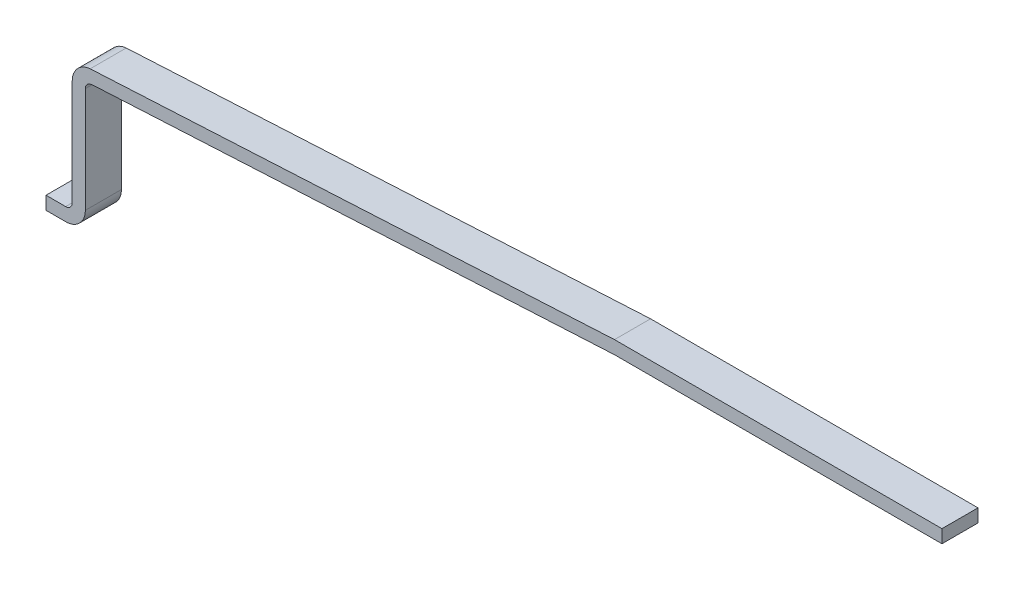
ISO-10303-21;
HEADER;
FILE_DESCRIPTION(('STEP AP214'),'2;1');
FILE_NAME('part.step','',(''),(''),'','','');
FILE_SCHEMA(('AUTOMOTIVE_DESIGN { 1 0 10303 214 1 1 1 1 }'));
ENDSEC;
DATA;
#1=APPLICATION_CONTEXT('core data for automotive mechanical design processes');
#2=APPLICATION_PROTOCOL_DEFINITION('international standard','automotive_design',2000,#1);
#3=PRODUCT_CONTEXT('',#1,'mechanical');
#4=PRODUCT('Part','Part','',(#3));
#5=PRODUCT_RELATED_PRODUCT_CATEGORY('part','',(#4));
#6=PRODUCT_DEFINITION_FORMATION('','',#4);
#7=PRODUCT_DEFINITION_CONTEXT('part definition',#1,'design');
#8=PRODUCT_DEFINITION('design','',#6,#7);
#9=PRODUCT_DEFINITION_SHAPE('','',#8);
#10=(LENGTH_UNIT() NAMED_UNIT(*) SI_UNIT(.MILLI.,.METRE.));
#11=(NAMED_UNIT(*) PLANE_ANGLE_UNIT() SI_UNIT($,.RADIAN.));
#12=(NAMED_UNIT(*) SI_UNIT($,.STERADIAN.) SOLID_ANGLE_UNIT());
#13=UNCERTAINTY_MEASURE_WITH_UNIT(LENGTH_MEASURE(1.E-05),#10,'distance_accuracy_value','');
#14=(GEOMETRIC_REPRESENTATION_CONTEXT(3) GLOBAL_UNCERTAINTY_ASSIGNED_CONTEXT((#13)) GLOBAL_UNIT_ASSIGNED_CONTEXT((#10,
#11,#12)) REPRESENTATION_CONTEXT('',''));
#15=CARTESIAN_POINT('',(0.,0.,0.));
#16=DIRECTION('',(0.,0.,1.));
#17=DIRECTION('',(1.,0.,0.));
#18=AXIS2_PLACEMENT_3D('',#15,#16,#17);
#19=CARTESIAN_POINT('',(-0.319177054542932,12.2710302640645,0.55));
#20=DIRECTION('',(1.,0.,0.));
#21=DIRECTION('',(0.,0.,-1.));
#22=AXIS2_PLACEMENT_3D('',#19,#20,#21);
#23=PLANE('',#22);
#24=DIRECTION('',(0.,-1.,0.));
#25=VECTOR('',#24,1.);
#26=CARTESIAN_POINT('',(-0.319177054542932,12.2710302640645,0.));
#27=LINE('',#26,#25);
#28=CARTESIAN_POINT('',(-0.319177054542932,12.4710302640645,0.));
#29=VERTEX_POINT('',#28);
#30=CARTESIAN_POINT('',(-0.319177054542932,12.2710302640645,0.));
#31=VERTEX_POINT('',#30);
#32=EDGE_CURVE('E172',#29,#31,#27,.T.);
#33=ORIENTED_EDGE('',*,*,#32,.T.);
#34=DIRECTION('',(0.,0.,-1.));
#35=VECTOR('',#34,1.);
#36=CARTESIAN_POINT('',(-0.319177054542932,12.2710302640645,0.55));
#37=LINE('',#36,#35);
#38=CARTESIAN_POINT('',(-0.319177054542932,12.2710302640645,0.55));
#39=VERTEX_POINT('',#38);
#40=EDGE_CURVE('E11',#39,#31,#37,.T.);
#41=ORIENTED_EDGE('',*,*,#40,.F.);
#42=DIRECTION('',(0.,-1.,0.));
#43=VECTOR('',#42,1.);
#44=CARTESIAN_POINT('',(-0.319177054542932,12.2710302640645,0.55));
#45=LINE('',#44,#43);
#46=CARTESIAN_POINT('',(-0.319177054542932,12.4710302640645,0.55));
#47=VERTEX_POINT('',#46);
#48=EDGE_CURVE('E200',#47,#39,#45,.T.);
#49=ORIENTED_EDGE('',*,*,#48,.F.);
#50=DIRECTION('',(0.,0.,-1.));
#51=VECTOR('',#50,1.);
#52=CARTESIAN_POINT('',(-0.319177054542932,12.4710302640645,0.55));
#53=LINE('',#52,#51);
#54=EDGE_CURVE('E168',#47,#29,#53,.T.);
#55=ORIENTED_EDGE('',*,*,#54,.T.);
#56=EDGE_LOOP('',(#33,#41,#49,#55));
#57=FACE_BOUND('',#56,.T.);
#58=ADVANCED_FACE('F34',(#57),#23,.F.);
#59=CARTESIAN_POINT('',(-0.0191770545429775,12.2710302640645,0.55));
#60=DIRECTION('',(0.,1.,0.));
#61=DIRECTION('',(-1.,0.,0.));
#62=AXIS2_PLACEMENT_3D('',#59,#60,#61);
#63=PLANE('',#62);
#64=DIRECTION('',(1.,0.,0.));
#65=VECTOR('',#64,1.);
#66=CARTESIAN_POINT('',(-0.0191770545429775,12.2710302640645,0.));
#67=LINE('',#66,#65);
#68=CARTESIAN_POINT('',(-0.0191770545429775,12.2710302640645,0.));
#69=VERTEX_POINT('',#68);
#70=EDGE_CURVE('E175',#31,#69,#67,.T.);
#71=ORIENTED_EDGE('',*,*,#70,.T.);
#72=DIRECTION('',(0.,0.,-1.));
#73=VECTOR('',#72,1.);
#74=CARTESIAN_POINT('',(-0.0191770545429775,12.2710302640645,0.55));
#75=LINE('',#74,#73);
#76=CARTESIAN_POINT('',(-0.0191770545429775,12.2710302640645,0.55));
#77=VERTEX_POINT('',#76);
#78=EDGE_CURVE('E42',#77,#69,#75,.T.);
#79=ORIENTED_EDGE('',*,*,#78,.F.);
#80=DIRECTION('',(1.,0.,0.));
#81=VECTOR('',#80,1.);
#82=CARTESIAN_POINT('',(-0.0191770545429775,12.2710302640645,0.55));
#83=LINE('',#82,#81);
#84=EDGE_CURVE('E114',#39,#77,#83,.T.);
#85=ORIENTED_EDGE('',*,*,#84,.F.);
#86=ORIENTED_EDGE('',*,*,#40,.T.);
#87=EDGE_LOOP('',(#71,#79,#85,#86));
#88=FACE_BOUND('',#87,.T.);
#89=ADVANCED_FACE('F293',(#88),#63,.F.);
#90=CARTESIAN_POINT('',(-0.0191770545430084,12.5710302640645,0.55));
#91=DIRECTION('',(0.,0.,-1.));
#92=DIRECTION('',(-1.,0.,0.));
#93=AXIS2_PLACEMENT_3D('',#90,#91,#92);
#94=CYLINDRICAL_SURFACE('',#93,0.300000000000008);
#95=CARTESIAN_POINT('',(-0.0191770545430084,12.5710302640645,0.));
#96=DIRECTION('',(0.,0.,1.));
#97=DIRECTION('',(1.,0.,0.));
#98=AXIS2_PLACEMENT_3D('',#95,#96,#97);
#99=CIRCLE('',#98,0.300000000000008);
#100=CARTESIAN_POINT('',(0.280822945457,12.5710302640645,0.));
#101=VERTEX_POINT('',#100);
#102=EDGE_CURVE('E177',#69,#101,#99,.T.);
#103=ORIENTED_EDGE('',*,*,#102,.T.);
#104=DIRECTION('',(0.,0.,-1.));
#105=VECTOR('',#104,1.);
#106=CARTESIAN_POINT('',(0.280822945457,12.5710302640645,0.55));
#107=LINE('',#106,#105);
#108=CARTESIAN_POINT('',(0.280822945457,12.5710302640645,0.55));
#109=VERTEX_POINT('',#108);
#110=EDGE_CURVE('E228',#109,#101,#107,.T.);
#111=ORIENTED_EDGE('',*,*,#110,.F.);
#112=CARTESIAN_POINT('',(-0.0191770545430084,12.5710302640645,0.55));
#113=DIRECTION('',(0.,0.,1.));
#114=DIRECTION('',(1.,0.,0.));
#115=AXIS2_PLACEMENT_3D('',#112,#113,#114);
#116=CIRCLE('',#115,0.300000000000008);
#117=EDGE_CURVE('E236',#77,#109,#116,.T.);
#118=ORIENTED_EDGE('',*,*,#117,.F.);
#119=ORIENTED_EDGE('',*,*,#78,.T.);
#120=EDGE_LOOP('',(#103,#111,#118,#119));
#121=FACE_BOUND('',#120,.T.);
#122=ADVANCED_FACE('F234',(#121),#94,.T.);
#123=CARTESIAN_POINT('',(0.280822945456877,14.1793971466627,0.55));
#124=DIRECTION('',(-1.,0.,0.));
#125=DIRECTION('',(0.,-1.,0.));
#126=AXIS2_PLACEMENT_3D('',#123,#124,#125);
#127=PLANE('',#126);
#128=DIRECTION('',(0.,1.,0.));
#129=VECTOR('',#128,1.);
#130=CARTESIAN_POINT('',(0.280822945456877,14.1793971466627,0.));
#131=LINE('',#130,#129);
#132=CARTESIAN_POINT('',(0.280822945456878,14.1793971466627,0.));
#133=VERTEX_POINT('',#132);
#134=EDGE_CURVE('E179',#101,#133,#131,.T.);
#135=ORIENTED_EDGE('',*,*,#134,.T.);
#136=DIRECTION('',(0.,0.,-1.));
#137=VECTOR('',#136,1.);
#138=CARTESIAN_POINT('',(0.280822945456878,14.1793971466627,0.55));
#139=LINE('',#138,#137);
#140=CARTESIAN_POINT('',(0.280822945456878,14.1793971466627,0.55));
#141=VERTEX_POINT('',#140);
#142=EDGE_CURVE('E225',#141,#133,#139,.T.);
#143=ORIENTED_EDGE('',*,*,#142,.F.);
#144=DIRECTION('',(0.,1.,0.));
#145=VECTOR('',#144,1.);
#146=CARTESIAN_POINT('',(0.280822945456877,14.1793971466627,0.55));
#147=LINE('',#146,#145);
#148=EDGE_CURVE('E254',#109,#141,#147,.T.);
#149=ORIENTED_EDGE('',*,*,#148,.F.);
#150=ORIENTED_EDGE('',*,*,#110,.T.);
#151=EDGE_LOOP('',(#135,#143,#149,#150));
#152=FACE_BOUND('',#151,.T.);
#153=ADVANCED_FACE('F245',(#152),#127,.F.);
#154=CARTESIAN_POINT('',(0.380822945456872,14.1793971466627,0.55));
#155=DIRECTION('',(0.,0.,-1.));
#156=DIRECTION('',(-1.,0.,0.));
#157=AXIS2_PLACEMENT_3D('',#154,#155,#156);
#158=CYLINDRICAL_SURFACE('',#157,0.0999999999999945);
#159=CARTESIAN_POINT('',(0.380822945456872,14.1793971466627,0.));
#160=DIRECTION('',(0.,0.,-1.));
#161=DIRECTION('',(-1.,0.,0.));
#162=AXIS2_PLACEMENT_3D('',#159,#160,#161);
#163=CIRCLE('',#162,0.0999999999999945);
#164=CARTESIAN_POINT('',(0.372107371182212,14.2790166164719,0.));
#165=VERTEX_POINT('',#164);
#166=EDGE_CURVE('E181',#133,#165,#163,.T.);
#167=ORIENTED_EDGE('',*,*,#166,.T.);
#168=DIRECTION('',(0.,0.,-1.));
#169=VECTOR('',#168,1.);
#170=CARTESIAN_POINT('',(0.372107371182212,14.2790166164719,0.55));
#171=LINE('',#170,#169);
#172=CARTESIAN_POINT('',(0.372107371182212,14.2790166164719,0.55));
#173=VERTEX_POINT('',#172);
#174=EDGE_CURVE('E222',#173,#165,#171,.T.);
#175=ORIENTED_EDGE('',*,*,#174,.F.);
#176=CARTESIAN_POINT('',(0.380822945456872,14.1793971466627,0.55));
#177=DIRECTION('',(0.,0.,-1.));
#178=DIRECTION('',(-1.,0.,0.));
#179=AXIS2_PLACEMENT_3D('',#176,#177,#178);
#180=CIRCLE('',#179,0.0999999999999945);
#181=EDGE_CURVE('E251',#141,#173,#180,.T.);
#182=ORIENTED_EDGE('',*,*,#181,.F.);
#183=ORIENTED_EDGE('',*,*,#142,.T.);
#184=EDGE_LOOP('',(#167,#175,#182,#183));
#185=FACE_BOUND('',#184,.T.);
#186=ADVANCED_FACE('F249',(#185),#158,.F.);
#187=CARTESIAN_POINT('',(0.432418849359921,14.2850571546016,0.55));
#188=DIRECTION('',(-0.099657105804021,0.995021839590853,0.));
#189=DIRECTION('',(-0.995021839590854,-0.099657105804021,0.));
#190=AXIS2_PLACEMENT_3D('',#187,#188,#189);
#191=PLANE('',#190);
#192=DIRECTION('',(0.995021839590854,0.099657105804021,0.));
#193=VECTOR('',#192,1.);
#194=CARTESIAN_POINT('',(0.432418849359921,14.2850571546016,0.));
#195=LINE('',#194,#193);
#196=CARTESIAN_POINT('',(0.432418849359921,14.2850571546016,0.));
#197=VERTEX_POINT('',#196);
#198=EDGE_CURVE('E183',#165,#197,#195,.T.);
#199=ORIENTED_EDGE('',*,*,#198,.T.);
#200=DIRECTION('',(0.,0.,-1.));
#201=VECTOR('',#200,1.);
#202=CARTESIAN_POINT('',(0.432418849359921,14.2850571546016,0.55));
#203=LINE('',#202,#201);
#204=CARTESIAN_POINT('',(0.432418849359921,14.2850571546016,0.55));
#205=VERTEX_POINT('',#204);
#206=EDGE_CURVE('E219',#205,#197,#203,.T.);
#207=ORIENTED_EDGE('',*,*,#206,.F.);
#208=DIRECTION('',(0.995021839590854,0.099657105804021,0.));
#209=VECTOR('',#208,1.);
#210=CARTESIAN_POINT('',(0.432418849359921,14.2850571546016,0.55));
#211=LINE('',#210,#209);
#212=EDGE_CURVE('E253',#173,#205,#211,.T.);
#213=ORIENTED_EDGE('',*,*,#212,.F.);
#214=ORIENTED_EDGE('',*,*,#174,.T.);
#215=EDGE_LOOP('',(#199,#207,#213,#214));
#216=FACE_BOUND('',#215,.T.);
#217=ADVANCED_FACE('F306',(#216),#191,.F.);
#218=CARTESIAN_POINT('',(8.35436609429098,14.7,0.55));
#219=DIRECTION('',(-0.0523071907961511,0.99863104187233,0.));
#220=DIRECTION('',(-0.99863104187233,-0.0523071907961511,0.));
#221=AXIS2_PLACEMENT_3D('',#218,#219,#220);
#222=PLANE('',#221);
#223=DIRECTION('',(0.99863104187233,0.0523071907961511,0.));
#224=VECTOR('',#223,1.);
#225=CARTESIAN_POINT('',(8.35436609429098,14.7,0.));
#226=LINE('',#225,#224);
#227=CARTESIAN_POINT('',(8.35436609429098,14.7,0.));
#228=VERTEX_POINT('',#227);
#229=EDGE_CURVE('E185',#197,#228,#226,.T.);
#230=ORIENTED_EDGE('',*,*,#229,.T.);
#231=DIRECTION('',(0.,0.,-1.));
#232=VECTOR('',#231,1.);
#233=CARTESIAN_POINT('',(8.35436609429098,14.7,0.55));
#234=LINE('',#233,#232);
#235=CARTESIAN_POINT('',(8.35436609429098,14.7,0.55));
#236=VERTEX_POINT('',#235);
#237=EDGE_CURVE('E216',#236,#228,#234,.T.);
#238=ORIENTED_EDGE('',*,*,#237,.F.);
#239=DIRECTION('',(0.99863104187233,0.0523071907961511,0.));
#240=VECTOR('',#239,1.);
#241=CARTESIAN_POINT('',(8.35436609429098,14.7,0.55));
#242=LINE('',#241,#240);
#243=EDGE_CURVE('E256',#205,#236,#242,.T.);
#244=ORIENTED_EDGE('',*,*,#243,.F.);
#245=ORIENTED_EDGE('',*,*,#206,.T.);
#246=EDGE_LOOP('',(#230,#238,#244,#245));
#247=FACE_BOUND('',#246,.T.);
#248=ADVANCED_FACE('F309',(#247),#222,.F.);
#249=CARTESIAN_POINT('',(13.3500000000001,14.6999999999999,0.55));
#250=DIRECTION('',(0.,1.,0.));
#251=DIRECTION('',(-1.,0.,0.));
#252=AXIS2_PLACEMENT_3D('',#249,#250,#251);
#253=PLANE('',#252);
#254=DIRECTION('',(1.,0.,0.));
#255=VECTOR('',#254,1.);
#256=CARTESIAN_POINT('',(13.3500000000001,14.6999999999999,0.));
#257=LINE('',#256,#255);
#258=CARTESIAN_POINT('',(13.3500000000001,14.6999999999999,0.));
#259=VERTEX_POINT('',#258);
#260=EDGE_CURVE('E187',#228,#259,#257,.T.);
#261=ORIENTED_EDGE('',*,*,#260,.T.);
#262=DIRECTION('',(0.,0.,-1.));
#263=VECTOR('',#262,1.);
#264=CARTESIAN_POINT('',(13.3500000000001,14.6999999999999,0.55));
#265=LINE('',#264,#263);
#266=CARTESIAN_POINT('',(13.3500000000001,14.6999999999999,0.55));
#267=VERTEX_POINT('',#266);
#268=EDGE_CURVE('E213',#267,#259,#265,.T.);
#269=ORIENTED_EDGE('',*,*,#268,.F.);
#270=DIRECTION('',(1.,0.,0.));
#271=VECTOR('',#270,1.);
#272=CARTESIAN_POINT('',(13.3500000000001,14.6999999999999,0.55));
#273=LINE('',#272,#271);
#274=EDGE_CURVE('E262',#236,#267,#273,.T.);
#275=ORIENTED_EDGE('',*,*,#274,.F.);
#276=ORIENTED_EDGE('',*,*,#237,.T.);
#277=EDGE_LOOP('',(#261,#269,#275,#276));
#278=FACE_BOUND('',#277,.T.);
#279=ADVANCED_FACE('F313',(#278),#253,.F.);
#280=CARTESIAN_POINT('',(13.3500000000001,14.9,0.55));
#281=DIRECTION('',(-1.,0.,0.));
#282=DIRECTION('',(0.,0.,1.));
#283=AXIS2_PLACEMENT_3D('',#280,#281,#282);
#284=PLANE('',#283);
#285=DIRECTION('',(0.,1.,0.));
#286=VECTOR('',#285,1.);
#287=CARTESIAN_POINT('',(13.3500000000001,14.9,0.));
#288=LINE('',#287,#286);
#289=CARTESIAN_POINT('',(13.3500000000001,14.9,0.));
#290=VERTEX_POINT('',#289);
#291=EDGE_CURVE('E189',#259,#290,#288,.T.);
#292=ORIENTED_EDGE('',*,*,#291,.T.);
#293=DIRECTION('',(0.,0.,-1.));
#294=VECTOR('',#293,1.);
#295=CARTESIAN_POINT('',(13.3500000000001,14.9,0.55));
#296=LINE('',#295,#294);
#297=CARTESIAN_POINT('',(13.3500000000001,14.9,0.55));
#298=VERTEX_POINT('',#297);
#299=EDGE_CURVE('E210',#298,#290,#296,.T.);
#300=ORIENTED_EDGE('',*,*,#299,.F.);
#301=DIRECTION('',(0.,1.,0.));
#302=VECTOR('',#301,1.);
#303=CARTESIAN_POINT('',(13.3500000000001,14.9,0.55));
#304=LINE('',#303,#302);
#305=EDGE_CURVE('E264',#267,#298,#304,.T.);
#306=ORIENTED_EDGE('',*,*,#305,.F.);
#307=ORIENTED_EDGE('',*,*,#268,.T.);
#308=EDGE_LOOP('',(#292,#300,#306,#307));
#309=FACE_BOUND('',#308,.T.);
#310=ADVANCED_FACE('F317',(#309),#284,.F.);
#311=CARTESIAN_POINT('',(8.35436609429098,14.9,0.55));
#312=DIRECTION('',(0.,-1.,0.));
#313=DIRECTION('',(0.,0.,-1.));
#314=AXIS2_PLACEMENT_3D('',#311,#312,#313);
#315=PLANE('',#314);
#316=DIRECTION('',(-1.,0.,0.));
#317=VECTOR('',#316,1.);
#318=CARTESIAN_POINT('',(8.35436609429098,14.9,0.));
#319=LINE('',#318,#317);
#320=CARTESIAN_POINT('',(8.35436609429098,14.9,0.));
#321=VERTEX_POINT('',#320);
#322=EDGE_CURVE('E191',#290,#321,#319,.T.);
#323=ORIENTED_EDGE('',*,*,#322,.T.);
#324=DIRECTION('',(0.,0.,-1.));
#325=VECTOR('',#324,1.);
#326=CARTESIAN_POINT('',(8.35436609429098,14.9,0.55));
#327=LINE('',#326,#325);
#328=CARTESIAN_POINT('',(8.35436609429098,14.9,0.55));
#329=VERTEX_POINT('',#328);
#330=EDGE_CURVE('E207',#329,#321,#327,.T.);
#331=ORIENTED_EDGE('',*,*,#330,.F.);
#332=DIRECTION('',(-1.,0.,0.));
#333=VECTOR('',#332,1.);
#334=CARTESIAN_POINT('',(8.35436609429098,14.9,0.55));
#335=LINE('',#334,#333);
#336=EDGE_CURVE('E266',#298,#329,#335,.T.);
#337=ORIENTED_EDGE('',*,*,#336,.F.);
#338=ORIENTED_EDGE('',*,*,#299,.T.);
#339=EDGE_LOOP('',(#323,#331,#337,#338));
#340=FACE_BOUND('',#339,.T.);
#341=ADVANCED_FACE('F321',(#340),#315,.F.);
#342=CARTESIAN_POINT('',(0.354676222632635,14.4782555560903,0.55));
#343=DIRECTION('',(0.0526469862556797,-0.998613185792274,0.));
#344=DIRECTION('',(0.998613185792274,0.0526469862556797,0.));
#345=AXIS2_PLACEMENT_3D('',#342,#343,#344);
#346=PLANE('',#345);
#347=DIRECTION('',(-0.998613185792274,-0.0526469862556797,0.));
#348=VECTOR('',#347,1.);
#349=CARTESIAN_POINT('',(0.354676222632635,14.4782555560903,0.));
#350=LINE('',#349,#348);
#351=CARTESIAN_POINT('',(0.354676222632635,14.4782555560903,0.));
#352=VERTEX_POINT('',#351);
#353=EDGE_CURVE('E193',#321,#352,#350,.T.);
#354=ORIENTED_EDGE('',*,*,#353,.T.);
#355=DIRECTION('',(0.,0.,-1.));
#356=VECTOR('',#355,1.);
#357=CARTESIAN_POINT('',(0.354676222632635,14.4782555560903,0.55));
#358=LINE('',#357,#356);
#359=CARTESIAN_POINT('',(0.354676222632635,14.4782555560903,0.55));
#360=VERTEX_POINT('',#359);
#361=EDGE_CURVE('E204',#360,#352,#358,.T.);
#362=ORIENTED_EDGE('',*,*,#361,.F.);
#363=DIRECTION('',(-0.998613185792274,-0.0526469862556797,0.));
#364=VECTOR('',#363,1.);
#365=CARTESIAN_POINT('',(0.354676222632635,14.4782555560903,0.55));
#366=LINE('',#365,#364);
#367=EDGE_CURVE('E268',#329,#360,#366,.T.);
#368=ORIENTED_EDGE('',*,*,#367,.F.);
#369=ORIENTED_EDGE('',*,*,#330,.T.);
#370=EDGE_LOOP('',(#354,#362,#368,#369));
#371=FACE_BOUND('',#370,.T.);
#372=ADVANCED_FACE('F274',(#371),#346,.F.);
#373=CARTESIAN_POINT('',(0.380822945456916,14.1793971466627,0.55));
#374=DIRECTION('',(0.,0.,-1.));
#375=DIRECTION('',(-1.,0.,0.));
#376=AXIS2_PLACEMENT_3D('',#373,#374,#375);
#377=CYLINDRICAL_SURFACE('',#376,0.300000000000013);
#378=CARTESIAN_POINT('',(0.380822945456916,14.1793971466627,0.));
#379=DIRECTION('',(0.,0.,1.));
#380=DIRECTION('',(1.,0.,0.));
#381=AXIS2_PLACEMENT_3D('',#378,#379,#380);
#382=CIRCLE('',#381,0.300000000000013);
#383=CARTESIAN_POINT('',(0.0808229454569033,14.1793971466627,0.));
#384=VERTEX_POINT('',#383);
#385=EDGE_CURVE('E195',#352,#384,#382,.T.);
#386=ORIENTED_EDGE('',*,*,#385,.T.);
#387=DIRECTION('',(0.,0.,-1.));
#388=VECTOR('',#387,1.);
#389=CARTESIAN_POINT('',(0.0808229454569033,14.1793971466627,0.55));
#390=LINE('',#389,#388);
#391=CARTESIAN_POINT('',(0.0808229454569033,14.1793971466627,0.55));
#392=VERTEX_POINT('',#391);
#393=EDGE_CURVE('E163',#392,#384,#390,.T.);
#394=ORIENTED_EDGE('',*,*,#393,.F.);
#395=CARTESIAN_POINT('',(0.380822945456916,14.1793971466627,0.55));
#396=DIRECTION('',(0.,0.,1.));
#397=DIRECTION('',(1.,0.,0.));
#398=AXIS2_PLACEMENT_3D('',#395,#396,#397);
#399=CIRCLE('',#398,0.300000000000013);
#400=EDGE_CURVE('E154',#360,#392,#399,.T.);
#401=ORIENTED_EDGE('',*,*,#400,.F.);
#402=ORIENTED_EDGE('',*,*,#361,.T.);
#403=EDGE_LOOP('',(#386,#394,#401,#402));
#404=FACE_BOUND('',#403,.T.);
#405=ADVANCED_FACE('F278',(#404),#377,.T.);
#406=CARTESIAN_POINT('',(0.0808229454569316,12.5710302640645,0.55));
#407=DIRECTION('',(1.,0.,0.));
#408=DIRECTION('',(0.,1.,0.));
#409=AXIS2_PLACEMENT_3D('',#406,#407,#408);
#410=PLANE('',#409);
#411=DIRECTION('',(0.,-1.,0.));
#412=VECTOR('',#411,1.);
#413=CARTESIAN_POINT('',(0.0808229454569316,12.5710302640645,0.));
#414=LINE('',#413,#412);
#415=CARTESIAN_POINT('',(0.0808229454569316,12.5710302640645,0.));
#416=VERTEX_POINT('',#415);
#417=EDGE_CURVE('E162',#384,#416,#414,.T.);
#418=ORIENTED_EDGE('',*,*,#417,.T.);
#419=DIRECTION('',(0.,0.,-1.));
#420=VECTOR('',#419,1.);
#421=CARTESIAN_POINT('',(0.0808229454569316,12.5710302640645,0.55));
#422=LINE('',#421,#420);
#423=CARTESIAN_POINT('',(0.0808229454569316,12.5710302640645,0.55));
#424=VERTEX_POINT('',#423);
#425=EDGE_CURVE('E159',#424,#416,#422,.T.);
#426=ORIENTED_EDGE('',*,*,#425,.F.);
#427=DIRECTION('',(0.,-1.,0.));
#428=VECTOR('',#427,1.);
#429=CARTESIAN_POINT('',(0.0808229454569316,12.5710302640645,0.55));
#430=LINE('',#429,#428);
#431=EDGE_CURVE('E148',#392,#424,#430,.T.);
#432=ORIENTED_EDGE('',*,*,#431,.F.);
#433=ORIENTED_EDGE('',*,*,#393,.T.);
#434=EDGE_LOOP('',(#418,#426,#432,#433));
#435=FACE_BOUND('',#434,.T.);
#436=ADVANCED_FACE('F160',(#435),#410,.F.);
#437=CARTESIAN_POINT('',(-0.0191770545430678,12.5710302640645,0.55));
#438=DIRECTION('',(0.,0.,-1.));
#439=DIRECTION('',(-1.,0.,0.));
#440=AXIS2_PLACEMENT_3D('',#437,#438,#439);
#441=CYLINDRICAL_SURFACE('',#440,0.0999999999999994);
#442=CARTESIAN_POINT('',(-0.0191770545430678,12.5710302640645,0.));
#443=DIRECTION('',(0.,0.,-1.));
#444=DIRECTION('',(1.,0.,0.));
#445=AXIS2_PLACEMENT_3D('',#442,#443,#444);
#446=CIRCLE('',#445,0.0999999999999994);
#447=CARTESIAN_POINT('',(-0.0191770545429775,12.4710302640645,0.));
#448=VERTEX_POINT('',#447);
#449=EDGE_CURVE('E100',#416,#448,#446,.T.);
#450=ORIENTED_EDGE('',*,*,#449,.T.);
#451=DIRECTION('',(0.,0.,-1.));
#452=VECTOR('',#451,1.);
#453=CARTESIAN_POINT('',(-0.0191770545429775,12.4710302640645,0.55));
#454=LINE('',#453,#452);
#455=CARTESIAN_POINT('',(-0.0191770545429775,12.4710302640645,0.55));
#456=VERTEX_POINT('',#455);
#457=EDGE_CURVE('E164',#456,#448,#454,.T.);
#458=ORIENTED_EDGE('',*,*,#457,.F.);
#459=CARTESIAN_POINT('',(-0.0191770545430678,12.5710302640645,0.55));
#460=DIRECTION('',(0.,0.,-1.));
#461=DIRECTION('',(1.,0.,0.));
#462=AXIS2_PLACEMENT_3D('',#459,#460,#461);
#463=CIRCLE('',#462,0.0999999999999994);
#464=EDGE_CURVE('E152',#424,#456,#463,.T.);
#465=ORIENTED_EDGE('',*,*,#464,.F.);
#466=ORIENTED_EDGE('',*,*,#425,.T.);
#467=EDGE_LOOP('',(#450,#458,#465,#466));
#468=FACE_BOUND('',#467,.T.);
#469=ADVANCED_FACE('F166',(#468),#441,.F.);
#470=CARTESIAN_POINT('',(-0.319177054542932,12.4710302640645,0.55));
#471=DIRECTION('',(0.,-1.,0.));
#472=DIRECTION('',(0.,0.,-1.));
#473=AXIS2_PLACEMENT_3D('',#470,#471,#472);
#474=PLANE('',#473);
#475=DIRECTION('',(-1.,0.,0.));
#476=VECTOR('',#475,1.);
#477=CARTESIAN_POINT('',(-0.319177054542932,12.4710302640645,0.));
#478=LINE('',#477,#476);
#479=EDGE_CURVE('E106',#448,#29,#478,.T.);
#480=ORIENTED_EDGE('',*,*,#479,.T.);
#481=ORIENTED_EDGE('',*,*,#54,.F.);
#482=DIRECTION('',(-1.,0.,0.));
#483=VECTOR('',#482,1.);
#484=CARTESIAN_POINT('',(-0.319177054542932,12.4710302640645,0.55));
#485=LINE('',#484,#483);
#486=EDGE_CURVE('E50',#456,#47,#485,.T.);
#487=ORIENTED_EDGE('',*,*,#486,.F.);
#488=ORIENTED_EDGE('',*,*,#457,.T.);
#489=EDGE_LOOP('',(#480,#481,#487,#488));
#490=FACE_BOUND('',#489,.T.);
#491=ADVANCED_FACE('F282',(#490),#474,.F.);
#492=CARTESIAN_POINT('',(-0.0191770545430678,12.5710302640645,0.55));
#493=DIRECTION('',(0.,0.,1.));
#494=DIRECTION('',(1.,0.,0.));
#495=AXIS2_PLACEMENT_3D('',#492,#493,#494);
#496=PLANE('',#495);
#497=ORIENTED_EDGE('',*,*,#48,.T.);
#498=ORIENTED_EDGE('',*,*,#84,.T.);
#499=ORIENTED_EDGE('',*,*,#117,.T.);
#500=ORIENTED_EDGE('',*,*,#148,.T.);
#501=ORIENTED_EDGE('',*,*,#181,.T.);
#502=ORIENTED_EDGE('',*,*,#212,.T.);
#503=ORIENTED_EDGE('',*,*,#243,.T.);
#504=ORIENTED_EDGE('',*,*,#274,.T.);
#505=ORIENTED_EDGE('',*,*,#305,.T.);
#506=ORIENTED_EDGE('',*,*,#336,.T.);
#507=ORIENTED_EDGE('',*,*,#367,.T.);
#508=ORIENTED_EDGE('',*,*,#400,.T.);
#509=ORIENTED_EDGE('',*,*,#431,.T.);
#510=ORIENTED_EDGE('',*,*,#464,.T.);
#511=ORIENTED_EDGE('',*,*,#486,.T.);
#512=EDGE_LOOP('',(#497,#498,#499,#500,#501,#502,#503,#504,#505,#506,#507,#508,#509,#510,#511));
#513=FACE_BOUND('',#512,.T.);
#514=ADVANCED_FACE('F150',(#513),#496,.T.);
#515=CARTESIAN_POINT('',(-0.0191770545430678,12.5710302640645,0.));
#516=DIRECTION('',(0.,0.,1.));
#517=DIRECTION('',(1.,0.,0.));
#518=AXIS2_PLACEMENT_3D('',#515,#516,#517);
#519=PLANE('',#518);
#520=ORIENTED_EDGE('',*,*,#32,.F.);
#521=ORIENTED_EDGE('',*,*,#479,.F.);
#522=ORIENTED_EDGE('',*,*,#449,.F.);
#523=ORIENTED_EDGE('',*,*,#417,.F.);
#524=ORIENTED_EDGE('',*,*,#385,.F.);
#525=ORIENTED_EDGE('',*,*,#353,.F.);
#526=ORIENTED_EDGE('',*,*,#322,.F.);
#527=ORIENTED_EDGE('',*,*,#291,.F.);
#528=ORIENTED_EDGE('',*,*,#260,.F.);
#529=ORIENTED_EDGE('',*,*,#229,.F.);
#530=ORIENTED_EDGE('',*,*,#198,.F.);
#531=ORIENTED_EDGE('',*,*,#166,.F.);
#532=ORIENTED_EDGE('',*,*,#134,.F.);
#533=ORIENTED_EDGE('',*,*,#102,.F.);
#534=ORIENTED_EDGE('',*,*,#70,.F.);
#535=EDGE_LOOP('',(#520,#521,#522,#523,#524,#525,#526,#527,#528,#529,#530,#531,#532,#533,#534));
#536=FACE_BOUND('',#535,.T.);
#537=ADVANCED_FACE('F240',(#536),#519,.F.);
#538=CLOSED_SHELL('',(#58,#89,#122,#153,#186,#217,#248,#279,#310,#341,#372,#405,#436,#469,#491,
#514,#537));
#539=MANIFOLD_SOLID_BREP('B2',#538);
#540=ADVANCED_BREP_SHAPE_REPRESENTATION('',(#18,#539),#14);
#541=SHAPE_DEFINITION_REPRESENTATION(#9,#540);
ENDSEC;
END-ISO-10303-21;
